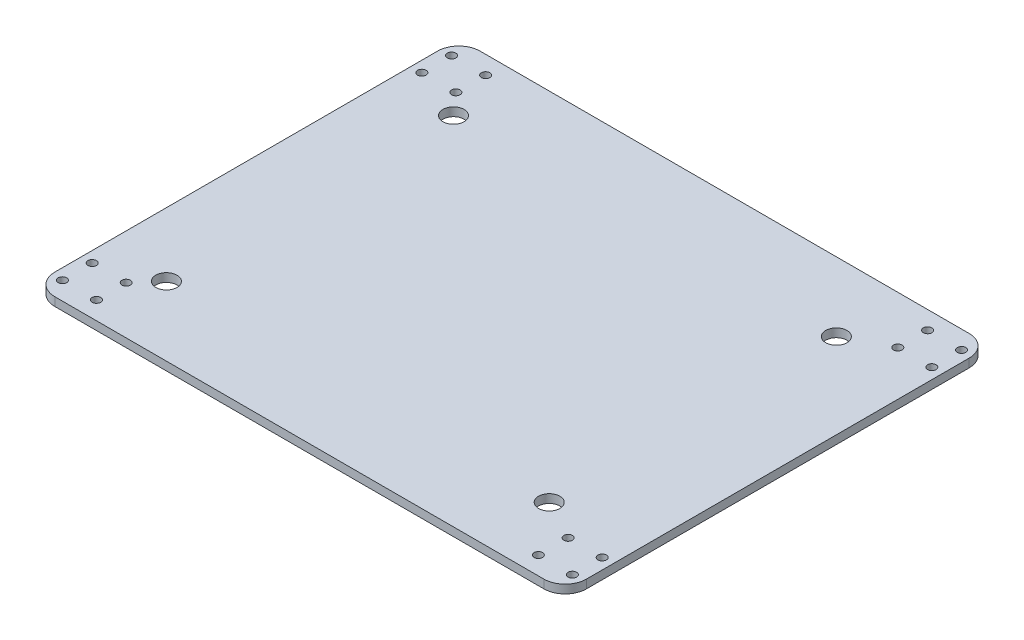
ISO-10303-21;
HEADER;
FILE_DESCRIPTION(('STEP AP214'),'2;1');
FILE_NAME('part.step','',(''),(''),'','','');
FILE_SCHEMA(('AUTOMOTIVE_DESIGN { 1 0 10303 214 1 1 1 1 }'));
ENDSEC;
DATA;
#1=APPLICATION_CONTEXT('core data for automotive mechanical design processes');
#2=APPLICATION_PROTOCOL_DEFINITION('international standard','automotive_design',2000,#1);
#3=PRODUCT_CONTEXT('',#1,'mechanical');
#4=PRODUCT('Part','Part','',(#3));
#5=PRODUCT_RELATED_PRODUCT_CATEGORY('part','',(#4));
#6=PRODUCT_DEFINITION_FORMATION('','',#4);
#7=PRODUCT_DEFINITION_CONTEXT('part definition',#1,'design');
#8=PRODUCT_DEFINITION('design','',#6,#7);
#9=PRODUCT_DEFINITION_SHAPE('','',#8);
#10=(LENGTH_UNIT() NAMED_UNIT(*) SI_UNIT(.MILLI.,.METRE.));
#11=(NAMED_UNIT(*) PLANE_ANGLE_UNIT() SI_UNIT($,.RADIAN.));
#12=(NAMED_UNIT(*) SI_UNIT($,.STERADIAN.) SOLID_ANGLE_UNIT());
#13=UNCERTAINTY_MEASURE_WITH_UNIT(LENGTH_MEASURE(1.E-05),#10,'distance_accuracy_value','');
#14=(GEOMETRIC_REPRESENTATION_CONTEXT(3) GLOBAL_UNCERTAINTY_ASSIGNED_CONTEXT((#13)) GLOBAL_UNIT_ASSIGNED_CONTEXT((#10,
#11,#12)) REPRESENTATION_CONTEXT('',''));
#15=CARTESIAN_POINT('',(0.,0.,0.));
#16=DIRECTION('',(0.,0.,1.));
#17=DIRECTION('',(1.,0.,0.));
#18=AXIS2_PLACEMENT_3D('',#15,#16,#17);
#19=CARTESIAN_POINT('',(0.,4.,0.));
#20=DIRECTION('',(0.,-1.,0.));
#21=DIRECTION('',(0.,0.,-1.));
#22=AXIS2_PLACEMENT_3D('',#19,#20,#21);
#23=PLANE('',#22);
#24=CARTESIAN_POINT('',(378.9,4.,-27.823868677906));
#25=DIRECTION('',(0.,-1.,0.));
#26=DIRECTION('',(0.,0.,-1.));
#27=AXIS2_PLACEMENT_3D('',#24,#25,#26);
#28=CIRCLE('',#27,2.);
#29=CARTESIAN_POINT('',(378.9,4.,-29.823868677906));
#30=VERTEX_POINT('',#29);
#31=EDGE_CURVE('E289',#30,#30,#28,.T.);
#32=ORIENTED_EDGE('',*,*,#31,.T.);
#33=EDGE_LOOP('',(#32));
#34=FACE_BOUND('',#33,.T.);
#35=CARTESIAN_POINT('',(171.1,4.,-196.823868677906));
#36=DIRECTION('',(0.,-1.,0.));
#37=DIRECTION('',(0.,0.,-1.));
#38=AXIS2_PLACEMENT_3D('',#35,#36,#37);
#39=CIRCLE('',#38,2.);
#40=CARTESIAN_POINT('',(171.1,4.,-198.823868677906));
#41=VERTEX_POINT('',#40);
#42=EDGE_CURVE('E250',#41,#41,#39,.T.);
#43=ORIENTED_EDGE('',*,*,#42,.T.);
#44=EDGE_LOOP('',(#43));
#45=FACE_BOUND('',#44,.T.);
#46=CARTESIAN_POINT('',(171.1,4.,-182.823868677906));
#47=DIRECTION('',(0.,-1.,0.));
#48=DIRECTION('',(0.,0.,-1.));
#49=AXIS2_PLACEMENT_3D('',#46,#47,#48);
#50=CIRCLE('',#49,2.);
#51=CARTESIAN_POINT('',(171.1,4.,-184.823868677906));
#52=VERTEX_POINT('',#51);
#53=EDGE_CURVE('E241',#52,#52,#50,.T.);
#54=ORIENTED_EDGE('',*,*,#53,.T.);
#55=EDGE_LOOP('',(#54));
#56=FACE_BOUND('',#55,.T.);
#57=CARTESIAN_POINT('',(155.1,4.,-182.823868677906));
#58=DIRECTION('',(0.,-1.,0.));
#59=DIRECTION('',(0.,0.,-1.));
#60=AXIS2_PLACEMENT_3D('',#57,#58,#59);
#61=CIRCLE('',#60,2.);
#62=CARTESIAN_POINT('',(155.1,4.,-184.823868677906));
#63=VERTEX_POINT('',#62);
#64=EDGE_CURVE('E266',#63,#63,#61,.T.);
#65=ORIENTED_EDGE('',*,*,#64,.T.);
#66=EDGE_LOOP('',(#65));
#67=FACE_BOUND('',#66,.T.);
#68=CARTESIAN_POINT('',(394.9,4.,-27.823868677906));
#69=DIRECTION('',(0.,-1.,0.));
#70=DIRECTION('',(0.,0.,-1.));
#71=AXIS2_PLACEMENT_3D('',#68,#69,#70);
#72=CIRCLE('',#71,2.);
#73=CARTESIAN_POINT('',(394.9,4.,-29.823868677906));
#74=VERTEX_POINT('',#73);
#75=EDGE_CURVE('E314',#74,#74,#72,.T.);
#76=ORIENTED_EDGE('',*,*,#75,.T.);
#77=EDGE_LOOP('',(#76));
#78=FACE_BOUND('',#77,.T.);
#79=CARTESIAN_POINT('',(394.9,4.,-13.823868677906));
#80=DIRECTION('',(0.,-1.,0.));
#81=DIRECTION('',(0.,0.,-1.));
#82=AXIS2_PLACEMENT_3D('',#79,#80,#81);
#83=CIRCLE('',#82,2.);
#84=CARTESIAN_POINT('',(394.9,4.,-15.823868677906));
#85=VERTEX_POINT('',#84);
#86=EDGE_CURVE('E322',#85,#85,#83,.T.);
#87=ORIENTED_EDGE('',*,*,#86,.T.);
#88=EDGE_LOOP('',(#87));
#89=FACE_BOUND('',#88,.T.);
#90=CARTESIAN_POINT('',(378.9,4.,-13.823868677906));
#91=DIRECTION('',(0.,-1.,0.));
#92=DIRECTION('',(0.,0.,-1.));
#93=AXIS2_PLACEMENT_3D('',#90,#91,#92);
#94=CIRCLE('',#93,2.);
#95=CARTESIAN_POINT('',(378.9,4.,-15.823868677906));
#96=VERTEX_POINT('',#95);
#97=EDGE_CURVE('E330',#96,#96,#94,.T.);
#98=ORIENTED_EDGE('',*,*,#97,.T.);
#99=EDGE_LOOP('',(#98));
#100=FACE_BOUND('',#99,.T.);
#101=CARTESIAN_POINT('',(155.1,4.,-196.823868677906));
#102=DIRECTION('',(0.,-1.,0.));
#103=DIRECTION('',(0.,0.,-1.));
#104=AXIS2_PLACEMENT_3D('',#101,#102,#103);
#105=CIRCLE('',#104,2.);
#106=CARTESIAN_POINT('',(155.1,4.,-198.823868677906));
#107=VERTEX_POINT('',#106);
#108=EDGE_CURVE('E229',#107,#107,#105,.T.);
#109=ORIENTED_EDGE('',*,*,#108,.T.);
#110=EDGE_LOOP('',(#109));
#111=FACE_BOUND('',#110,.T.);
#112=CARTESIAN_POINT('',(360.,4.,-37.8238686779061));
#113=DIRECTION('',(0.,1.,0.));
#114=DIRECTION('',(0.,0.,1.));
#115=AXIS2_PLACEMENT_3D('',#112,#113,#114);
#116=CIRCLE('',#115,4.99999999999999);
#117=CARTESIAN_POINT('',(360.,4.,-32.8238686779061));
#118=VERTEX_POINT('',#117);
#119=EDGE_CURVE('E214',#118,#118,#116,.T.);
#120=ORIENTED_EDGE('',*,*,#119,.F.);
#121=EDGE_LOOP('',(#120));
#122=FACE_BOUND('',#121,.T.);
#123=CARTESIAN_POINT('',(180.,4.,-172.823868677906));
#124=DIRECTION('',(0.,1.,0.));
#125=DIRECTION('',(0.,0.,1.));
#126=AXIS2_PLACEMENT_3D('',#123,#124,#125);
#127=CIRCLE('',#126,4.99999999999996);
#128=CARTESIAN_POINT('',(180.,4.,-167.823868677906));
#129=VERTEX_POINT('',#128);
#130=EDGE_CURVE('E151',#129,#129,#127,.T.);
#131=ORIENTED_EDGE('',*,*,#130,.F.);
#132=EDGE_LOOP('',(#131));
#133=FACE_BOUND('',#132,.T.);
#134=DIRECTION('',(-1.,0.,0.));
#135=VECTOR('',#134,1.);
#136=CARTESIAN_POINT('',(150.,4.,-205.323868677906));
#137=LINE('',#136,#135);
#138=CARTESIAN_POINT('',(390.,4.,-205.323868677906));
#139=VERTEX_POINT('',#138);
#140=CARTESIAN_POINT('',(160.,4.,-205.323868677906));
#141=VERTEX_POINT('',#140);
#142=EDGE_CURVE('E154',#139,#141,#137,.T.);
#143=ORIENTED_EDGE('',*,*,#142,.T.);
#144=CARTESIAN_POINT('',(160.,4.,-195.323868677906));
#145=DIRECTION('',(0.,-1.,0.));
#146=DIRECTION('',(0.,0.,-1.));
#147=AXIS2_PLACEMENT_3D('',#144,#145,#146);
#148=CIRCLE('',#147,10.);
#149=CARTESIAN_POINT('',(150.,4.,-195.323868677906));
#150=VERTEX_POINT('',#149);
#151=EDGE_CURVE('E184',#141,#150,#148,.F.);
#152=ORIENTED_EDGE('',*,*,#151,.T.);
#153=DIRECTION('',(0.,0.,1.));
#154=VECTOR('',#153,1.);
#155=CARTESIAN_POINT('',(150.,4.,-5.323868677906));
#156=LINE('',#155,#154);
#157=CARTESIAN_POINT('',(150.,4.,-15.323868677906));
#158=VERTEX_POINT('',#157);
#159=EDGE_CURVE('E133',#150,#158,#156,.T.);
#160=ORIENTED_EDGE('',*,*,#159,.T.);
#161=CARTESIAN_POINT('',(160.,4.,-15.323868677906));
#162=DIRECTION('',(0.,-1.,0.));
#163=DIRECTION('',(0.,0.,-1.));
#164=AXIS2_PLACEMENT_3D('',#161,#162,#163);
#165=CIRCLE('',#164,10.);
#166=CARTESIAN_POINT('',(160.,4.,-5.323868677906));
#167=VERTEX_POINT('',#166);
#168=EDGE_CURVE('E181',#158,#167,#165,.F.);
#169=ORIENTED_EDGE('',*,*,#168,.T.);
#170=DIRECTION('',(1.,0.,0.));
#171=VECTOR('',#170,1.);
#172=CARTESIAN_POINT('',(150.,4.,-5.323868677906));
#173=LINE('',#172,#171);
#174=CARTESIAN_POINT('',(390.,4.,-5.323868677906));
#175=VERTEX_POINT('',#174);
#176=EDGE_CURVE('E199',#167,#175,#173,.T.);
#177=ORIENTED_EDGE('',*,*,#176,.T.);
#178=CARTESIAN_POINT('',(390.,4.,-15.323868677906));
#179=DIRECTION('',(0.,-1.,0.));
#180=DIRECTION('',(0.,0.,-1.));
#181=AXIS2_PLACEMENT_3D('',#178,#179,#180);
#182=CIRCLE('',#181,10.);
#183=CARTESIAN_POINT('',(400.,4.,-15.323868677906));
#184=VERTEX_POINT('',#183);
#185=EDGE_CURVE('E67',#175,#184,#182,.F.);
#186=ORIENTED_EDGE('',*,*,#185,.T.);
#187=DIRECTION('',(0.,0.,-1.));
#188=VECTOR('',#187,1.);
#189=CARTESIAN_POINT('',(400.,4.,-5.323868677906));
#190=LINE('',#189,#188);
#191=CARTESIAN_POINT('',(400.,4.,-195.323868677906));
#192=VERTEX_POINT('',#191);
#193=EDGE_CURVE('E197',#184,#192,#190,.T.);
#194=ORIENTED_EDGE('',*,*,#193,.T.);
#195=CARTESIAN_POINT('',(390.,4.,-195.323868677906));
#196=DIRECTION('',(0.,-1.,0.));
#197=DIRECTION('',(0.,0.,-1.));
#198=AXIS2_PLACEMENT_3D('',#195,#196,#197);
#199=CIRCLE('',#198,10.);
#200=EDGE_CURVE('E176',#192,#139,#199,.F.);
#201=ORIENTED_EDGE('',*,*,#200,.T.);
#202=EDGE_LOOP('',(#143,#152,#160,#169,#177,#186,#194,#201));
#203=FACE_BOUND('',#202,.T.);
#204=CARTESIAN_POINT('',(180.,4.,-37.8238686779061));
#205=DIRECTION('',(0.,-1.,0.));
#206=DIRECTION('',(0.,0.,-1.));
#207=AXIS2_PLACEMENT_3D('',#204,#205,#206);
#208=CIRCLE('',#207,4.99999999999999);
#209=CARTESIAN_POINT('',(180.,4.,-42.8238686779061));
#210=VERTEX_POINT('',#209);
#211=EDGE_CURVE('E213',#210,#210,#208,.T.);
#212=ORIENTED_EDGE('',*,*,#211,.T.);
#213=EDGE_LOOP('',(#212));
#214=FACE_BOUND('',#213,.T.);
#215=CARTESIAN_POINT('',(360.,4.,-172.823868677906));
#216=DIRECTION('',(0.,-1.,0.));
#217=DIRECTION('',(0.,0.,-1.));
#218=AXIS2_PLACEMENT_3D('',#215,#216,#217);
#219=CIRCLE('',#218,4.99999999999999);
#220=CARTESIAN_POINT('',(360.,4.,-177.823868677906));
#221=VERTEX_POINT('',#220);
#222=EDGE_CURVE('E207',#221,#221,#219,.T.);
#223=ORIENTED_EDGE('',*,*,#222,.T.);
#224=EDGE_LOOP('',(#223));
#225=FACE_BOUND('',#224,.T.);
#226=CARTESIAN_POINT('',(378.9,4.,-196.823868677906));
#227=DIRECTION('',(0.,1.,0.));
#228=DIRECTION('',(0.,0.,1.));
#229=AXIS2_PLACEMENT_3D('',#226,#227,#228);
#230=CIRCLE('',#229,2.);
#231=CARTESIAN_POINT('',(378.9,4.,-194.823868677906));
#232=VERTEX_POINT('',#231);
#233=EDGE_CURVE('E305',#232,#232,#230,.T.);
#234=ORIENTED_EDGE('',*,*,#233,.F.);
#235=EDGE_LOOP('',(#234));
#236=FACE_BOUND('',#235,.T.);
#237=CARTESIAN_POINT('',(378.9,4.,-182.823868677906));
#238=DIRECTION('',(0.,1.,0.));
#239=DIRECTION('',(0.,0.,1.));
#240=AXIS2_PLACEMENT_3D('',#237,#238,#239);
#241=CIRCLE('',#240,2.);
#242=CARTESIAN_POINT('',(378.9,4.,-180.823868677906));
#243=VERTEX_POINT('',#242);
#244=EDGE_CURVE('E353',#243,#243,#241,.T.);
#245=ORIENTED_EDGE('',*,*,#244,.F.);
#246=EDGE_LOOP('',(#245));
#247=FACE_BOUND('',#246,.T.);
#248=CARTESIAN_POINT('',(394.9,4.,-182.823868677906));
#249=DIRECTION('',(0.,1.,0.));
#250=DIRECTION('',(0.,0.,1.));
#251=AXIS2_PLACEMENT_3D('',#248,#249,#250);
#252=CIRCLE('',#251,2.);
#253=CARTESIAN_POINT('',(394.9,4.,-180.823868677906));
#254=VERTEX_POINT('',#253);
#255=EDGE_CURVE('E345',#254,#254,#252,.T.);
#256=ORIENTED_EDGE('',*,*,#255,.F.);
#257=EDGE_LOOP('',(#256));
#258=FACE_BOUND('',#257,.T.);
#259=CARTESIAN_POINT('',(394.9,4.,-196.823868677906));
#260=DIRECTION('',(0.,1.,0.));
#261=DIRECTION('',(0.,0.,1.));
#262=AXIS2_PLACEMENT_3D('',#259,#260,#261);
#263=CIRCLE('',#262,2.);
#264=CARTESIAN_POINT('',(394.9,4.,-194.823868677906));
#265=VERTEX_POINT('',#264);
#266=EDGE_CURVE('E337',#265,#265,#263,.T.);
#267=ORIENTED_EDGE('',*,*,#266,.F.);
#268=EDGE_LOOP('',(#267));
#269=FACE_BOUND('',#268,.T.);
#270=CARTESIAN_POINT('',(171.1,4.,-27.823868677906));
#271=DIRECTION('',(0.,1.,0.));
#272=DIRECTION('',(0.,0.,1.));
#273=AXIS2_PLACEMENT_3D('',#270,#271,#272);
#274=CIRCLE('',#273,2.);
#275=CARTESIAN_POINT('',(171.1,4.,-25.823868677906));
#276=VERTEX_POINT('',#275);
#277=EDGE_CURVE('E257',#276,#276,#274,.T.);
#278=ORIENTED_EDGE('',*,*,#277,.F.);
#279=EDGE_LOOP('',(#278));
#280=FACE_BOUND('',#279,.T.);
#281=CARTESIAN_POINT('',(155.1,4.,-13.823868677906));
#282=DIRECTION('',(0.,1.,0.));
#283=DIRECTION('',(0.,0.,1.));
#284=AXIS2_PLACEMENT_3D('',#281,#282,#283);
#285=CIRCLE('',#284,2.);
#286=CARTESIAN_POINT('',(155.1,4.,-11.823868677906));
#287=VERTEX_POINT('',#286);
#288=EDGE_CURVE('E298',#287,#287,#285,.T.);
#289=ORIENTED_EDGE('',*,*,#288,.F.);
#290=EDGE_LOOP('',(#289));
#291=FACE_BOUND('',#290,.T.);
#292=CARTESIAN_POINT('',(155.1,4.,-27.823868677906));
#293=DIRECTION('',(0.,1.,0.));
#294=DIRECTION('',(0.,0.,1.));
#295=AXIS2_PLACEMENT_3D('',#292,#293,#294);
#296=CIRCLE('',#295,2.);
#297=CARTESIAN_POINT('',(155.1,4.,-25.823868677906));
#298=VERTEX_POINT('',#297);
#299=EDGE_CURVE('E273',#298,#298,#296,.T.);
#300=ORIENTED_EDGE('',*,*,#299,.F.);
#301=EDGE_LOOP('',(#300));
#302=FACE_BOUND('',#301,.T.);
#303=CARTESIAN_POINT('',(171.1,4.,-13.823868677906));
#304=DIRECTION('',(0.,1.,0.));
#305=DIRECTION('',(0.,0.,1.));
#306=AXIS2_PLACEMENT_3D('',#303,#304,#305);
#307=CIRCLE('',#306,2.);
#308=CARTESIAN_POINT('',(171.1,4.,-11.823868677906));
#309=VERTEX_POINT('',#308);
#310=EDGE_CURVE('E282',#309,#309,#307,.T.);
#311=ORIENTED_EDGE('',*,*,#310,.F.);
#312=EDGE_LOOP('',(#311));
#313=FACE_BOUND('',#312,.T.);
#314=ADVANCED_FACE('F45',(#34,#45,#56,#67,#78,#89,#100,#111,#122,#133,#203,#214,#225,#236,#247,
#258,#269,#280,#291,#302,#313),#23,.F.);
#315=CARTESIAN_POINT('',(0.,0.,0.));
#316=DIRECTION('',(0.,-1.,0.));
#317=DIRECTION('',(0.,0.,-1.));
#318=AXIS2_PLACEMENT_3D('',#315,#316,#317);
#319=PLANE('',#318);
#320=CARTESIAN_POINT('',(155.1,0.,-27.823868677906));
#321=DIRECTION('',(0.,1.,0.));
#322=DIRECTION('',(0.,0.,1.));
#323=AXIS2_PLACEMENT_3D('',#320,#321,#322);
#324=CIRCLE('',#323,2.);
#325=CARTESIAN_POINT('',(155.1,0.,-25.823868677906));
#326=VERTEX_POINT('',#325);
#327=EDGE_CURVE('E277',#326,#326,#324,.T.);
#328=ORIENTED_EDGE('',*,*,#327,.T.);
#329=EDGE_LOOP('',(#328));
#330=FACE_BOUND('',#329,.T.);
#331=CARTESIAN_POINT('',(171.1,0.,-27.823868677906));
#332=DIRECTION('',(0.,1.,0.));
#333=DIRECTION('',(0.,0.,1.));
#334=AXIS2_PLACEMENT_3D('',#331,#332,#333);
#335=CIRCLE('',#334,2.);
#336=CARTESIAN_POINT('',(171.1,0.,-25.823868677906));
#337=VERTEX_POINT('',#336);
#338=EDGE_CURVE('E261',#337,#337,#335,.T.);
#339=ORIENTED_EDGE('',*,*,#338,.T.);
#340=EDGE_LOOP('',(#339));
#341=FACE_BOUND('',#340,.T.);
#342=CARTESIAN_POINT('',(394.9,0.,-182.823868677906));
#343=DIRECTION('',(0.,1.,0.));
#344=DIRECTION('',(0.,0.,1.));
#345=AXIS2_PLACEMENT_3D('',#342,#343,#344);
#346=CIRCLE('',#345,2.);
#347=CARTESIAN_POINT('',(394.9,0.,-180.823868677906));
#348=VERTEX_POINT('',#347);
#349=EDGE_CURVE('E349',#348,#348,#346,.T.);
#350=ORIENTED_EDGE('',*,*,#349,.T.);
#351=EDGE_LOOP('',(#350));
#352=FACE_BOUND('',#351,.T.);
#353=CARTESIAN_POINT('',(378.9,0.,-196.823868677906));
#354=DIRECTION('',(0.,1.,0.));
#355=DIRECTION('',(0.,0.,1.));
#356=AXIS2_PLACEMENT_3D('',#353,#354,#355);
#357=CIRCLE('',#356,2.);
#358=CARTESIAN_POINT('',(378.9,0.,-194.823868677906));
#359=VERTEX_POINT('',#358);
#360=EDGE_CURVE('E309',#359,#359,#357,.T.);
#361=ORIENTED_EDGE('',*,*,#360,.T.);
#362=EDGE_LOOP('',(#361));
#363=FACE_BOUND('',#362,.T.);
#364=CARTESIAN_POINT('',(394.9,0.,-27.823868677906));
#365=DIRECTION('',(0.,-1.,0.));
#366=DIRECTION('',(0.,0.,-1.));
#367=AXIS2_PLACEMENT_3D('',#364,#365,#366);
#368=CIRCLE('',#367,2.);
#369=CARTESIAN_POINT('',(394.9,0.,-29.823868677906));
#370=VERTEX_POINT('',#369);
#371=EDGE_CURVE('E318',#370,#370,#368,.T.);
#372=ORIENTED_EDGE('',*,*,#371,.F.);
#373=EDGE_LOOP('',(#372));
#374=FACE_BOUND('',#373,.T.);
#375=CARTESIAN_POINT('',(394.9,0.,-13.823868677906));
#376=DIRECTION('',(0.,-1.,0.));
#377=DIRECTION('',(0.,0.,-1.));
#378=AXIS2_PLACEMENT_3D('',#375,#376,#377);
#379=CIRCLE('',#378,2.);
#380=CARTESIAN_POINT('',(394.9,0.,-15.823868677906));
#381=VERTEX_POINT('',#380);
#382=EDGE_CURVE('E326',#381,#381,#379,.T.);
#383=ORIENTED_EDGE('',*,*,#382,.F.);
#384=EDGE_LOOP('',(#383));
#385=FACE_BOUND('',#384,.T.);
#386=CARTESIAN_POINT('',(378.9,0.,-13.823868677906));
#387=DIRECTION('',(0.,-1.,0.));
#388=DIRECTION('',(0.,0.,-1.));
#389=AXIS2_PLACEMENT_3D('',#386,#387,#388);
#390=CIRCLE('',#389,2.);
#391=CARTESIAN_POINT('',(378.9,0.,-15.823868677906));
#392=VERTEX_POINT('',#391);
#393=EDGE_CURVE('E294',#392,#392,#390,.T.);
#394=ORIENTED_EDGE('',*,*,#393,.F.);
#395=EDGE_LOOP('',(#394));
#396=FACE_BOUND('',#395,.T.);
#397=CARTESIAN_POINT('',(155.1,0.,-196.823868677906));
#398=DIRECTION('',(0.,-1.,0.));
#399=DIRECTION('',(0.,0.,-1.));
#400=AXIS2_PLACEMENT_3D('',#397,#398,#399);
#401=CIRCLE('',#400,2.);
#402=CARTESIAN_POINT('',(155.1,0.,-198.823868677906));
#403=VERTEX_POINT('',#402);
#404=EDGE_CURVE('E233',#403,#403,#401,.T.);
#405=ORIENTED_EDGE('',*,*,#404,.F.);
#406=EDGE_LOOP('',(#405));
#407=FACE_BOUND('',#406,.T.);
#408=CARTESIAN_POINT('',(180.,0.,-37.8238686779061));
#409=DIRECTION('',(0.,-1.,0.));
#410=DIRECTION('',(0.,0.,-1.));
#411=AXIS2_PLACEMENT_3D('',#408,#409,#410);
#412=CIRCLE('',#411,4.99999999999999);
#413=CARTESIAN_POINT('',(180.,0.,-42.8238686779061));
#414=VERTEX_POINT('',#413);
#415=EDGE_CURVE('E209',#414,#414,#412,.T.);
#416=ORIENTED_EDGE('',*,*,#415,.F.);
#417=EDGE_LOOP('',(#416));
#418=FACE_BOUND('',#417,.T.);
#419=CARTESIAN_POINT('',(360.,0.,-37.8238686779061));
#420=DIRECTION('',(0.,1.,0.));
#421=DIRECTION('',(0.,0.,1.));
#422=AXIS2_PLACEMENT_3D('',#419,#420,#421);
#423=CIRCLE('',#422,4.99999999999999);
#424=CARTESIAN_POINT('',(360.,0.,-32.8238686779061));
#425=VERTEX_POINT('',#424);
#426=EDGE_CURVE('E225',#425,#425,#423,.T.);
#427=ORIENTED_EDGE('',*,*,#426,.T.);
#428=EDGE_LOOP('',(#427));
#429=FACE_BOUND('',#428,.T.);
#430=CARTESIAN_POINT('',(180.,0.,-172.823868677906));
#431=DIRECTION('',(0.,1.,0.));
#432=DIRECTION('',(0.,0.,1.));
#433=AXIS2_PLACEMENT_3D('',#430,#431,#432);
#434=CIRCLE('',#433,4.99999999999996);
#435=CARTESIAN_POINT('',(180.,0.,-167.823868677906));
#436=VERTEX_POINT('',#435);
#437=EDGE_CURVE('E143',#436,#436,#434,.T.);
#438=ORIENTED_EDGE('',*,*,#437,.T.);
#439=EDGE_LOOP('',(#438));
#440=FACE_BOUND('',#439,.T.);
#441=DIRECTION('',(0.,0.,1.));
#442=VECTOR('',#441,1.);
#443=CARTESIAN_POINT('',(150.,0.,-5.323868677906));
#444=LINE('',#443,#442);
#445=CARTESIAN_POINT('',(150.,0.,-195.323868677906));
#446=VERTEX_POINT('',#445);
#447=CARTESIAN_POINT('',(150.,0.,-15.323868677906));
#448=VERTEX_POINT('',#447);
#449=EDGE_CURVE('E130',#446,#448,#444,.T.);
#450=ORIENTED_EDGE('',*,*,#449,.F.);
#451=CARTESIAN_POINT('',(160.,0.,-195.323868677906));
#452=DIRECTION('',(0.,-1.,0.));
#453=DIRECTION('',(0.,0.,-1.));
#454=AXIS2_PLACEMENT_3D('',#451,#452,#453);
#455=CIRCLE('',#454,10.);
#456=CARTESIAN_POINT('',(160.,0.,-205.323868677906));
#457=VERTEX_POINT('',#456);
#458=EDGE_CURVE('E112',#446,#457,#455,.T.);
#459=ORIENTED_EDGE('',*,*,#458,.T.);
#460=DIRECTION('',(-1.,0.,0.));
#461=VECTOR('',#460,1.);
#462=CARTESIAN_POINT('',(150.,0.,-205.323868677906));
#463=LINE('',#462,#461);
#464=CARTESIAN_POINT('',(390.,0.,-205.323868677906));
#465=VERTEX_POINT('',#464);
#466=EDGE_CURVE('E159',#465,#457,#463,.T.);
#467=ORIENTED_EDGE('',*,*,#466,.F.);
#468=CARTESIAN_POINT('',(390.,0.,-195.323868677906));
#469=DIRECTION('',(0.,-1.,0.));
#470=DIRECTION('',(0.,0.,-1.));
#471=AXIS2_PLACEMENT_3D('',#468,#469,#470);
#472=CIRCLE('',#471,10.);
#473=CARTESIAN_POINT('',(400.,0.,-195.323868677906));
#474=VERTEX_POINT('',#473);
#475=EDGE_CURVE('E135',#465,#474,#472,.T.);
#476=ORIENTED_EDGE('',*,*,#475,.T.);
#477=DIRECTION('',(0.,0.,-1.));
#478=VECTOR('',#477,1.);
#479=CARTESIAN_POINT('',(400.,0.,-5.323868677906));
#480=LINE('',#479,#478);
#481=CARTESIAN_POINT('',(400.,0.,-15.323868677906));
#482=VERTEX_POINT('',#481);
#483=EDGE_CURVE('E148',#482,#474,#480,.T.);
#484=ORIENTED_EDGE('',*,*,#483,.F.);
#485=CARTESIAN_POINT('',(390.,0.,-15.323868677906));
#486=DIRECTION('',(0.,-1.,0.));
#487=DIRECTION('',(0.,0.,-1.));
#488=AXIS2_PLACEMENT_3D('',#485,#486,#487);
#489=CIRCLE('',#488,10.);
#490=CARTESIAN_POINT('',(390.,0.,-5.323868677906));
#491=VERTEX_POINT('',#490);
#492=EDGE_CURVE('E166',#482,#491,#489,.T.);
#493=ORIENTED_EDGE('',*,*,#492,.T.);
#494=DIRECTION('',(1.,0.,0.));
#495=VECTOR('',#494,1.);
#496=CARTESIAN_POINT('',(150.,0.,-5.323868677906));
#497=LINE('',#496,#495);
#498=CARTESIAN_POINT('',(160.,0.,-5.323868677906));
#499=VERTEX_POINT('',#498);
#500=EDGE_CURVE('E142',#499,#491,#497,.T.);
#501=ORIENTED_EDGE('',*,*,#500,.F.);
#502=CARTESIAN_POINT('',(160.,0.,-15.323868677906));
#503=DIRECTION('',(0.,-1.,0.));
#504=DIRECTION('',(0.,0.,-1.));
#505=AXIS2_PLACEMENT_3D('',#502,#503,#504);
#506=CIRCLE('',#505,10.);
#507=EDGE_CURVE('E124',#499,#448,#506,.T.);
#508=ORIENTED_EDGE('',*,*,#507,.T.);
#509=EDGE_LOOP('',(#450,#459,#467,#476,#484,#493,#501,#508));
#510=FACE_BOUND('',#509,.T.);
#511=CARTESIAN_POINT('',(360.,0.,-172.823868677906));
#512=DIRECTION('',(0.,-1.,0.));
#513=DIRECTION('',(0.,0.,-1.));
#514=AXIS2_PLACEMENT_3D('',#511,#512,#513);
#515=CIRCLE('',#514,4.99999999999999);
#516=CARTESIAN_POINT('',(360.,0.,-177.823868677906));
#517=VERTEX_POINT('',#516);
#518=EDGE_CURVE('E218',#517,#517,#515,.T.);
#519=ORIENTED_EDGE('',*,*,#518,.F.);
#520=EDGE_LOOP('',(#519));
#521=FACE_BOUND('',#520,.T.);
#522=CARTESIAN_POINT('',(378.9,0.,-182.823868677906));
#523=DIRECTION('',(0.,1.,0.));
#524=DIRECTION('',(0.,0.,1.));
#525=AXIS2_PLACEMENT_3D('',#522,#523,#524);
#526=CIRCLE('',#525,2.);
#527=CARTESIAN_POINT('',(378.9,0.,-180.823868677906));
#528=VERTEX_POINT('',#527);
#529=EDGE_CURVE('E310',#528,#528,#526,.T.);
#530=ORIENTED_EDGE('',*,*,#529,.T.);
#531=EDGE_LOOP('',(#530));
#532=FACE_BOUND('',#531,.T.);
#533=CARTESIAN_POINT('',(394.9,0.,-196.823868677906));
#534=DIRECTION('',(0.,1.,0.));
#535=DIRECTION('',(0.,0.,1.));
#536=AXIS2_PLACEMENT_3D('',#533,#534,#535);
#537=CIRCLE('',#536,2.);
#538=CARTESIAN_POINT('',(394.9,0.,-194.823868677906));
#539=VERTEX_POINT('',#538);
#540=EDGE_CURVE('E341',#539,#539,#537,.T.);
#541=ORIENTED_EDGE('',*,*,#540,.T.);
#542=EDGE_LOOP('',(#541));
#543=FACE_BOUND('',#542,.T.);
#544=CARTESIAN_POINT('',(155.1,0.,-182.823868677906));
#545=DIRECTION('',(0.,-1.,0.));
#546=DIRECTION('',(0.,0.,-1.));
#547=AXIS2_PLACEMENT_3D('',#544,#545,#546);
#548=CIRCLE('',#547,2.);
#549=CARTESIAN_POINT('',(155.1,0.,-184.823868677906));
#550=VERTEX_POINT('',#549);
#551=EDGE_CURVE('E246',#550,#550,#548,.T.);
#552=ORIENTED_EDGE('',*,*,#551,.F.);
#553=EDGE_LOOP('',(#552));
#554=FACE_BOUND('',#553,.T.);
#555=CARTESIAN_POINT('',(171.1,0.,-182.823868677906));
#556=DIRECTION('',(0.,-1.,0.));
#557=DIRECTION('',(0.,0.,-1.));
#558=AXIS2_PLACEMENT_3D('',#555,#556,#557);
#559=CIRCLE('',#558,2.);
#560=CARTESIAN_POINT('',(171.1,0.,-184.823868677906));
#561=VERTEX_POINT('',#560);
#562=EDGE_CURVE('E245',#561,#561,#559,.T.);
#563=ORIENTED_EDGE('',*,*,#562,.F.);
#564=EDGE_LOOP('',(#563));
#565=FACE_BOUND('',#564,.T.);
#566=CARTESIAN_POINT('',(171.1,0.,-196.823868677906));
#567=DIRECTION('',(0.,-1.,0.));
#568=DIRECTION('',(0.,0.,-1.));
#569=AXIS2_PLACEMENT_3D('',#566,#567,#568);
#570=CIRCLE('',#569,2.);
#571=CARTESIAN_POINT('',(171.1,0.,-198.823868677906));
#572=VERTEX_POINT('',#571);
#573=EDGE_CURVE('E237',#572,#572,#570,.T.);
#574=ORIENTED_EDGE('',*,*,#573,.F.);
#575=EDGE_LOOP('',(#574));
#576=FACE_BOUND('',#575,.T.);
#577=CARTESIAN_POINT('',(378.9,0.,-27.823868677906));
#578=DIRECTION('',(0.,-1.,0.));
#579=DIRECTION('',(0.,0.,-1.));
#580=AXIS2_PLACEMENT_3D('',#577,#578,#579);
#581=CIRCLE('',#580,2.);
#582=CARTESIAN_POINT('',(378.9,0.,-29.823868677906));
#583=VERTEX_POINT('',#582);
#584=EDGE_CURVE('E293',#583,#583,#581,.T.);
#585=ORIENTED_EDGE('',*,*,#584,.F.);
#586=EDGE_LOOP('',(#585));
#587=FACE_BOUND('',#586,.T.);
#588=CARTESIAN_POINT('',(155.1,0.,-13.823868677906));
#589=DIRECTION('',(0.,1.,0.));
#590=DIRECTION('',(0.,0.,1.));
#591=AXIS2_PLACEMENT_3D('',#588,#589,#590);
#592=CIRCLE('',#591,2.);
#593=CARTESIAN_POINT('',(155.1,0.,-11.823868677906));
#594=VERTEX_POINT('',#593);
#595=EDGE_CURVE('E278',#594,#594,#592,.T.);
#596=ORIENTED_EDGE('',*,*,#595,.T.);
#597=EDGE_LOOP('',(#596));
#598=FACE_BOUND('',#597,.T.);
#599=CARTESIAN_POINT('',(171.1,0.,-13.823868677906));
#600=DIRECTION('',(0.,1.,0.));
#601=DIRECTION('',(0.,0.,1.));
#602=AXIS2_PLACEMENT_3D('',#599,#600,#601);
#603=CIRCLE('',#602,2.);
#604=CARTESIAN_POINT('',(171.1,0.,-11.823868677906));
#605=VERTEX_POINT('',#604);
#606=EDGE_CURVE('E262',#605,#605,#603,.T.);
#607=ORIENTED_EDGE('',*,*,#606,.T.);
#608=EDGE_LOOP('',(#607));
#609=FACE_BOUND('',#608,.T.);
#610=ADVANCED_FACE('F138',(#330,#341,#352,#363,#374,#385,#396,#407,#418,#429,#440,#510,#521,
#532,#543,#554,#565,#576,#587,#598,#609),#319,.T.);
#611=CARTESIAN_POINT('',(150.,4.,-5.323868677906));
#612=DIRECTION('',(1.,0.,0.));
#613=DIRECTION('',(0.,0.,-1.));
#614=AXIS2_PLACEMENT_3D('',#611,#612,#613);
#615=PLANE('',#614);
#616=ORIENTED_EDGE('',*,*,#159,.F.);
#617=DIRECTION('',(0.,-1.,0.));
#618=VECTOR('',#617,1.);
#619=CARTESIAN_POINT('',(150.,4.,-195.323868677906));
#620=LINE('',#619,#618);
#621=EDGE_CURVE('E116',#150,#446,#620,.T.);
#622=ORIENTED_EDGE('',*,*,#621,.T.);
#623=ORIENTED_EDGE('',*,*,#449,.T.);
#624=DIRECTION('',(0.,-1.,0.));
#625=VECTOR('',#624,1.);
#626=CARTESIAN_POINT('',(150.,4.,-15.323868677906));
#627=LINE('',#626,#625);
#628=EDGE_CURVE('E136',#448,#158,#627,.F.);
#629=ORIENTED_EDGE('',*,*,#628,.T.);
#630=EDGE_LOOP('',(#616,#622,#623,#629));
#631=FACE_BOUND('',#630,.T.);
#632=ADVANCED_FACE('F129',(#631),#615,.F.);
#633=CARTESIAN_POINT('',(150.,4.,-5.323868677906));
#634=DIRECTION('',(0.,0.,-1.));
#635=DIRECTION('',(-1.,0.,0.));
#636=AXIS2_PLACEMENT_3D('',#633,#634,#635);
#637=PLANE('',#636);
#638=ORIENTED_EDGE('',*,*,#176,.F.);
#639=DIRECTION('',(0.,-1.,0.));
#640=VECTOR('',#639,1.);
#641=CARTESIAN_POINT('',(160.,4.,-5.323868677906));
#642=LINE('',#641,#640);
#643=EDGE_CURVE('E190',#167,#499,#642,.T.);
#644=ORIENTED_EDGE('',*,*,#643,.T.);
#645=ORIENTED_EDGE('',*,*,#500,.T.);
#646=DIRECTION('',(0.,-1.,0.));
#647=VECTOR('',#646,1.);
#648=CARTESIAN_POINT('',(390.,4.,-5.323868677906));
#649=LINE('',#648,#647);
#650=EDGE_CURVE('E187',#491,#175,#649,.F.);
#651=ORIENTED_EDGE('',*,*,#650,.T.);
#652=EDGE_LOOP('',(#638,#644,#645,#651));
#653=FACE_BOUND('',#652,.T.);
#654=ADVANCED_FACE('F400',(#653),#637,.F.);
#655=CARTESIAN_POINT('',(400.,4.,-5.323868677906));
#656=DIRECTION('',(-1.,0.,0.));
#657=DIRECTION('',(0.,0.,1.));
#658=AXIS2_PLACEMENT_3D('',#655,#656,#657);
#659=PLANE('',#658);
#660=ORIENTED_EDGE('',*,*,#193,.F.);
#661=DIRECTION('',(0.,-1.,0.));
#662=VECTOR('',#661,1.);
#663=CARTESIAN_POINT('',(400.,4.,-15.323868677906));
#664=LINE('',#663,#662);
#665=EDGE_CURVE('E11',#184,#482,#664,.T.);
#666=ORIENTED_EDGE('',*,*,#665,.T.);
#667=ORIENTED_EDGE('',*,*,#483,.T.);
#668=DIRECTION('',(0.,-1.,0.));
#669=VECTOR('',#668,1.);
#670=CARTESIAN_POINT('',(400.,4.,-195.323868677906));
#671=LINE('',#670,#669);
#672=EDGE_CURVE('E54',#474,#192,#671,.F.);
#673=ORIENTED_EDGE('',*,*,#672,.T.);
#674=EDGE_LOOP('',(#660,#666,#667,#673));
#675=FACE_BOUND('',#674,.T.);
#676=ADVANCED_FACE('F396',(#675),#659,.F.);
#677=CARTESIAN_POINT('',(150.,4.,-205.323868677906));
#678=DIRECTION('',(0.,0.,1.));
#679=DIRECTION('',(1.,0.,0.));
#680=AXIS2_PLACEMENT_3D('',#677,#678,#679);
#681=PLANE('',#680);
#682=ORIENTED_EDGE('',*,*,#466,.T.);
#683=DIRECTION('',(0.,-1.,0.));
#684=VECTOR('',#683,1.);
#685=CARTESIAN_POINT('',(160.,4.,-205.323868677906));
#686=LINE('',#685,#684);
#687=EDGE_CURVE('E117',#457,#141,#686,.F.);
#688=ORIENTED_EDGE('',*,*,#687,.T.);
#689=ORIENTED_EDGE('',*,*,#142,.F.);
#690=DIRECTION('',(0.,-1.,0.));
#691=VECTOR('',#690,1.);
#692=CARTESIAN_POINT('',(390.,4.,-205.323868677906));
#693=LINE('',#692,#691);
#694=EDGE_CURVE('E123',#139,#465,#693,.T.);
#695=ORIENTED_EDGE('',*,*,#694,.T.);
#696=EDGE_LOOP('',(#682,#688,#689,#695));
#697=FACE_BOUND('',#696,.T.);
#698=ADVANCED_FACE('F393',(#697),#681,.F.);
#699=CARTESIAN_POINT('',(180.,0.,-172.823868677906));
#700=DIRECTION('',(0.,1.,0.));
#701=DIRECTION('',(0.,0.,1.));
#702=AXIS2_PLACEMENT_3D('',#699,#700,#701);
#703=CYLINDRICAL_SURFACE('',#702,4.99999999999996);
#704=ORIENTED_EDGE('',*,*,#437,.F.);
#705=EDGE_LOOP('',(#704));
#706=FACE_BOUND('',#705,.T.);
#707=ORIENTED_EDGE('',*,*,#130,.T.);
#708=EDGE_LOOP('',(#707));
#709=FACE_BOUND('',#708,.T.);
#710=ADVANCED_FACE('F390',(#706,#709),#703,.F.);
#711=CARTESIAN_POINT('',(360.,0.,-37.8238686779061));
#712=DIRECTION('',(0.,1.,0.));
#713=DIRECTION('',(0.,0.,1.));
#714=AXIS2_PLACEMENT_3D('',#711,#712,#713);
#715=CYLINDRICAL_SURFACE('',#714,4.99999999999999);
#716=ORIENTED_EDGE('',*,*,#426,.F.);
#717=EDGE_LOOP('',(#716));
#718=FACE_BOUND('',#717,.T.);
#719=ORIENTED_EDGE('',*,*,#119,.T.);
#720=EDGE_LOOP('',(#719));
#721=FACE_BOUND('',#720,.T.);
#722=ADVANCED_FACE('F483',(#718,#721),#715,.F.);
#723=CARTESIAN_POINT('',(180.,0.,-37.8238686779061));
#724=DIRECTION('',(0.,1.,0.));
#725=DIRECTION('',(0.,0.,1.));
#726=AXIS2_PLACEMENT_3D('',#723,#724,#725);
#727=CYLINDRICAL_SURFACE('',#726,4.99999999999999);
#728=ORIENTED_EDGE('',*,*,#415,.T.);
#729=EDGE_LOOP('',(#728));
#730=FACE_BOUND('',#729,.T.);
#731=ORIENTED_EDGE('',*,*,#211,.F.);
#732=EDGE_LOOP('',(#731));
#733=FACE_BOUND('',#732,.T.);
#734=ADVANCED_FACE('F486',(#730,#733),#727,.F.);
#735=CARTESIAN_POINT('',(360.,0.,-172.823868677906));
#736=DIRECTION('',(0.,1.,0.));
#737=DIRECTION('',(0.,0.,1.));
#738=AXIS2_PLACEMENT_3D('',#735,#736,#737);
#739=CYLINDRICAL_SURFACE('',#738,4.99999999999999);
#740=ORIENTED_EDGE('',*,*,#518,.T.);
#741=EDGE_LOOP('',(#740));
#742=FACE_BOUND('',#741,.T.);
#743=ORIENTED_EDGE('',*,*,#222,.F.);
#744=EDGE_LOOP('',(#743));
#745=FACE_BOUND('',#744,.T.);
#746=ADVANCED_FACE('F481',(#742,#745),#739,.F.);
#747=CARTESIAN_POINT('',(155.1,4.,-196.823868677906));
#748=DIRECTION('',(0.,-1.,0.));
#749=DIRECTION('',(0.,0.,-1.));
#750=AXIS2_PLACEMENT_3D('',#747,#748,#749);
#751=CYLINDRICAL_SURFACE('',#750,2.);
#752=ORIENTED_EDGE('',*,*,#108,.F.);
#753=EDGE_LOOP('',(#752));
#754=FACE_BOUND('',#753,.T.);
#755=ORIENTED_EDGE('',*,*,#404,.T.);
#756=EDGE_LOOP('',(#755));
#757=FACE_BOUND('',#756,.T.);
#758=ADVANCED_FACE('F477',(#754,#757),#751,.F.);
#759=CARTESIAN_POINT('',(378.9,4.,-13.823868677906));
#760=DIRECTION('',(0.,-1.,0.));
#761=DIRECTION('',(0.,0.,-1.));
#762=AXIS2_PLACEMENT_3D('',#759,#760,#761);
#763=CYLINDRICAL_SURFACE('',#762,2.);
#764=ORIENTED_EDGE('',*,*,#97,.F.);
#765=EDGE_LOOP('',(#764));
#766=FACE_BOUND('',#765,.T.);
#767=ORIENTED_EDGE('',*,*,#393,.T.);
#768=EDGE_LOOP('',(#767));
#769=FACE_BOUND('',#768,.T.);
#770=ADVANCED_FACE('F480',(#766,#769),#763,.F.);
#771=CARTESIAN_POINT('',(394.9,4.,-13.823868677906));
#772=DIRECTION('',(0.,-1.,0.));
#773=DIRECTION('',(0.,0.,-1.));
#774=AXIS2_PLACEMENT_3D('',#771,#772,#773);
#775=CYLINDRICAL_SURFACE('',#774,2.);
#776=ORIENTED_EDGE('',*,*,#86,.F.);
#777=EDGE_LOOP('',(#776));
#778=FACE_BOUND('',#777,.T.);
#779=ORIENTED_EDGE('',*,*,#382,.T.);
#780=EDGE_LOOP('',(#779));
#781=FACE_BOUND('',#780,.T.);
#782=ADVANCED_FACE('F550',(#778,#781),#775,.F.);
#783=CARTESIAN_POINT('',(394.9,4.,-27.823868677906));
#784=DIRECTION('',(0.,-1.,0.));
#785=DIRECTION('',(0.,0.,-1.));
#786=AXIS2_PLACEMENT_3D('',#783,#784,#785);
#787=CYLINDRICAL_SURFACE('',#786,2.);
#788=ORIENTED_EDGE('',*,*,#75,.F.);
#789=EDGE_LOOP('',(#788));
#790=FACE_BOUND('',#789,.T.);
#791=ORIENTED_EDGE('',*,*,#371,.T.);
#792=EDGE_LOOP('',(#791));
#793=FACE_BOUND('',#792,.T.);
#794=ADVANCED_FACE('F376',(#790,#793),#787,.F.);
#795=CARTESIAN_POINT('',(378.9,4.,-196.823868677906));
#796=DIRECTION('',(0.,-1.,0.));
#797=DIRECTION('',(0.,0.,-1.));
#798=AXIS2_PLACEMENT_3D('',#795,#796,#797);
#799=CYLINDRICAL_SURFACE('',#798,2.);
#800=ORIENTED_EDGE('',*,*,#233,.T.);
#801=EDGE_LOOP('',(#800));
#802=FACE_BOUND('',#801,.T.);
#803=ORIENTED_EDGE('',*,*,#360,.F.);
#804=EDGE_LOOP('',(#803));
#805=FACE_BOUND('',#804,.T.);
#806=ADVANCED_FACE('F366',(#802,#805),#799,.F.);
#807=CARTESIAN_POINT('',(378.9,4.,-182.823868677906));
#808=DIRECTION('',(0.,-1.,0.));
#809=DIRECTION('',(0.,0.,-1.));
#810=AXIS2_PLACEMENT_3D('',#807,#808,#809);
#811=CYLINDRICAL_SURFACE('',#810,2.);
#812=ORIENTED_EDGE('',*,*,#244,.T.);
#813=EDGE_LOOP('',(#812));
#814=FACE_BOUND('',#813,.T.);
#815=ORIENTED_EDGE('',*,*,#529,.F.);
#816=EDGE_LOOP('',(#815));
#817=FACE_BOUND('',#816,.T.);
#818=ADVANCED_FACE('F363',(#814,#817),#811,.F.);
#819=CARTESIAN_POINT('',(394.9,4.,-182.823868677906));
#820=DIRECTION('',(0.,-1.,0.));
#821=DIRECTION('',(0.,0.,-1.));
#822=AXIS2_PLACEMENT_3D('',#819,#820,#821);
#823=CYLINDRICAL_SURFACE('',#822,2.);
#824=ORIENTED_EDGE('',*,*,#255,.T.);
#825=EDGE_LOOP('',(#824));
#826=FACE_BOUND('',#825,.T.);
#827=ORIENTED_EDGE('',*,*,#349,.F.);
#828=EDGE_LOOP('',(#827));
#829=FACE_BOUND('',#828,.T.);
#830=ADVANCED_FACE('F365',(#826,#829),#823,.F.);
#831=CARTESIAN_POINT('',(394.9,4.,-196.823868677906));
#832=DIRECTION('',(0.,-1.,0.));
#833=DIRECTION('',(0.,0.,-1.));
#834=AXIS2_PLACEMENT_3D('',#831,#832,#833);
#835=CYLINDRICAL_SURFACE('',#834,2.);
#836=ORIENTED_EDGE('',*,*,#266,.T.);
#837=EDGE_LOOP('',(#836));
#838=FACE_BOUND('',#837,.T.);
#839=ORIENTED_EDGE('',*,*,#540,.F.);
#840=EDGE_LOOP('',(#839));
#841=FACE_BOUND('',#840,.T.);
#842=ADVANCED_FACE('F373',(#838,#841),#835,.F.);
#843=CARTESIAN_POINT('',(171.1,4.,-27.823868677906));
#844=DIRECTION('',(0.,-1.,0.));
#845=DIRECTION('',(0.,0.,-1.));
#846=AXIS2_PLACEMENT_3D('',#843,#844,#845);
#847=CYLINDRICAL_SURFACE('',#846,2.);
#848=ORIENTED_EDGE('',*,*,#277,.T.);
#849=EDGE_LOOP('',(#848));
#850=FACE_BOUND('',#849,.T.);
#851=ORIENTED_EDGE('',*,*,#338,.F.);
#852=EDGE_LOOP('',(#851));
#853=FACE_BOUND('',#852,.T.);
#854=ADVANCED_FACE('F465',(#850,#853),#847,.F.);
#855=CARTESIAN_POINT('',(155.1,4.,-182.823868677906));
#856=DIRECTION('',(0.,-1.,0.));
#857=DIRECTION('',(0.,0.,-1.));
#858=AXIS2_PLACEMENT_3D('',#855,#856,#857);
#859=CYLINDRICAL_SURFACE('',#858,2.);
#860=ORIENTED_EDGE('',*,*,#64,.F.);
#861=EDGE_LOOP('',(#860));
#862=FACE_BOUND('',#861,.T.);
#863=ORIENTED_EDGE('',*,*,#551,.T.);
#864=EDGE_LOOP('',(#863));
#865=FACE_BOUND('',#864,.T.);
#866=ADVANCED_FACE('F461',(#862,#865),#859,.F.);
#867=CARTESIAN_POINT('',(171.1,4.,-182.823868677906));
#868=DIRECTION('',(0.,-1.,0.));
#869=DIRECTION('',(0.,0.,-1.));
#870=AXIS2_PLACEMENT_3D('',#867,#868,#869);
#871=CYLINDRICAL_SURFACE('',#870,2.);
#872=ORIENTED_EDGE('',*,*,#53,.F.);
#873=EDGE_LOOP('',(#872));
#874=FACE_BOUND('',#873,.T.);
#875=ORIENTED_EDGE('',*,*,#562,.T.);
#876=EDGE_LOOP('',(#875));
#877=FACE_BOUND('',#876,.T.);
#878=ADVANCED_FACE('F464',(#874,#877),#871,.F.);
#879=CARTESIAN_POINT('',(171.1,4.,-196.823868677906));
#880=DIRECTION('',(0.,-1.,0.));
#881=DIRECTION('',(0.,0.,-1.));
#882=AXIS2_PLACEMENT_3D('',#879,#880,#881);
#883=CYLINDRICAL_SURFACE('',#882,2.);
#884=ORIENTED_EDGE('',*,*,#42,.F.);
#885=EDGE_LOOP('',(#884));
#886=FACE_BOUND('',#885,.T.);
#887=ORIENTED_EDGE('',*,*,#573,.T.);
#888=EDGE_LOOP('',(#887));
#889=FACE_BOUND('',#888,.T.);
#890=ADVANCED_FACE('F470',(#886,#889),#883,.F.);
#891=CARTESIAN_POINT('',(378.9,4.,-27.823868677906));
#892=DIRECTION('',(0.,-1.,0.));
#893=DIRECTION('',(0.,0.,-1.));
#894=AXIS2_PLACEMENT_3D('',#891,#892,#893);
#895=CYLINDRICAL_SURFACE('',#894,2.);
#896=ORIENTED_EDGE('',*,*,#31,.F.);
#897=EDGE_LOOP('',(#896));
#898=FACE_BOUND('',#897,.T.);
#899=ORIENTED_EDGE('',*,*,#584,.T.);
#900=EDGE_LOOP('',(#899));
#901=FACE_BOUND('',#900,.T.);
#902=ADVANCED_FACE('F458',(#898,#901),#895,.F.);
#903=CARTESIAN_POINT('',(155.1,4.,-13.823868677906));
#904=DIRECTION('',(0.,-1.,0.));
#905=DIRECTION('',(0.,0.,-1.));
#906=AXIS2_PLACEMENT_3D('',#903,#904,#905);
#907=CYLINDRICAL_SURFACE('',#906,2.);
#908=ORIENTED_EDGE('',*,*,#288,.T.);
#909=EDGE_LOOP('',(#908));
#910=FACE_BOUND('',#909,.T.);
#911=ORIENTED_EDGE('',*,*,#595,.F.);
#912=EDGE_LOOP('',(#911));
#913=FACE_BOUND('',#912,.T.);
#914=ADVANCED_FACE('F454',(#910,#913),#907,.F.);
#915=CARTESIAN_POINT('',(155.1,4.,-27.823868677906));
#916=DIRECTION('',(0.,-1.,0.));
#917=DIRECTION('',(0.,0.,-1.));
#918=AXIS2_PLACEMENT_3D('',#915,#916,#917);
#919=CYLINDRICAL_SURFACE('',#918,2.);
#920=ORIENTED_EDGE('',*,*,#299,.T.);
#921=EDGE_LOOP('',(#920));
#922=FACE_BOUND('',#921,.T.);
#923=ORIENTED_EDGE('',*,*,#327,.F.);
#924=EDGE_LOOP('',(#923));
#925=FACE_BOUND('',#924,.T.);
#926=ADVANCED_FACE('F447',(#922,#925),#919,.F.);
#927=CARTESIAN_POINT('',(171.1,4.,-13.823868677906));
#928=DIRECTION('',(0.,-1.,0.));
#929=DIRECTION('',(0.,0.,-1.));
#930=AXIS2_PLACEMENT_3D('',#927,#928,#929);
#931=CYLINDRICAL_SURFACE('',#930,2.);
#932=ORIENTED_EDGE('',*,*,#310,.T.);
#933=EDGE_LOOP('',(#932));
#934=FACE_BOUND('',#933,.T.);
#935=ORIENTED_EDGE('',*,*,#606,.F.);
#936=EDGE_LOOP('',(#935));
#937=FACE_BOUND('',#936,.T.);
#938=ADVANCED_FACE('F409',(#934,#937),#931,.F.);
#939=CARTESIAN_POINT('',(160.,4.,-195.323868677906));
#940=DIRECTION('',(0.,-1.,0.));
#941=DIRECTION('',(0.,0.,-1.));
#942=AXIS2_PLACEMENT_3D('',#939,#940,#941);
#943=CYLINDRICAL_SURFACE('',#942,10.);
#944=ORIENTED_EDGE('',*,*,#151,.F.);
#945=ORIENTED_EDGE('',*,*,#687,.F.);
#946=ORIENTED_EDGE('',*,*,#458,.F.);
#947=ORIENTED_EDGE('',*,*,#621,.F.);
#948=EDGE_LOOP('',(#944,#945,#946,#947));
#949=FACE_BOUND('',#948,.T.);
#950=ADVANCED_FACE('F115',(#949),#943,.T.);
#951=CARTESIAN_POINT('',(160.,4.,-15.323868677906));
#952=DIRECTION('',(0.,-1.,0.));
#953=DIRECTION('',(0.,0.,-1.));
#954=AXIS2_PLACEMENT_3D('',#951,#952,#953);
#955=CYLINDRICAL_SURFACE('',#954,10.);
#956=ORIENTED_EDGE('',*,*,#168,.F.);
#957=ORIENTED_EDGE('',*,*,#628,.F.);
#958=ORIENTED_EDGE('',*,*,#507,.F.);
#959=ORIENTED_EDGE('',*,*,#643,.F.);
#960=EDGE_LOOP('',(#956,#957,#958,#959));
#961=FACE_BOUND('',#960,.T.);
#962=ADVANCED_FACE('F408',(#961),#955,.T.);
#963=CARTESIAN_POINT('',(390.,4.,-15.323868677906));
#964=DIRECTION('',(0.,-1.,0.));
#965=DIRECTION('',(0.,0.,-1.));
#966=AXIS2_PLACEMENT_3D('',#963,#964,#965);
#967=CYLINDRICAL_SURFACE('',#966,10.);
#968=ORIENTED_EDGE('',*,*,#185,.F.);
#969=ORIENTED_EDGE('',*,*,#650,.F.);
#970=ORIENTED_EDGE('',*,*,#492,.F.);
#971=ORIENTED_EDGE('',*,*,#665,.F.);
#972=EDGE_LOOP('',(#968,#969,#970,#971));
#973=FACE_BOUND('',#972,.T.);
#974=ADVANCED_FACE('F411',(#973),#967,.T.);
#975=CARTESIAN_POINT('',(390.,4.,-195.323868677906));
#976=DIRECTION('',(0.,-1.,0.));
#977=DIRECTION('',(0.,0.,-1.));
#978=AXIS2_PLACEMENT_3D('',#975,#976,#977);
#979=CYLINDRICAL_SURFACE('',#978,10.);
#980=ORIENTED_EDGE('',*,*,#200,.F.);
#981=ORIENTED_EDGE('',*,*,#672,.F.);
#982=ORIENTED_EDGE('',*,*,#475,.F.);
#983=ORIENTED_EDGE('',*,*,#694,.F.);
#984=EDGE_LOOP('',(#980,#981,#982,#983));
#985=FACE_BOUND('',#984,.T.);
#986=ADVANCED_FACE('F47',(#985),#979,.T.);
#987=CLOSED_SHELL('',(#314,#610,#632,#654,#676,#698,#710,#722,#734,#746,#758,#770,#782,#794,
#806,#818,#830,#842,#854,#866,#878,#890,#902,#914,#926,#938,#950,#962,#974,#986));
#988=MANIFOLD_SOLID_BREP('B2',#987);
#989=ADVANCED_BREP_SHAPE_REPRESENTATION('',(#18,#988),#14);
#990=SHAPE_DEFINITION_REPRESENTATION(#9,#989);
ENDSEC;
END-ISO-10303-21;
